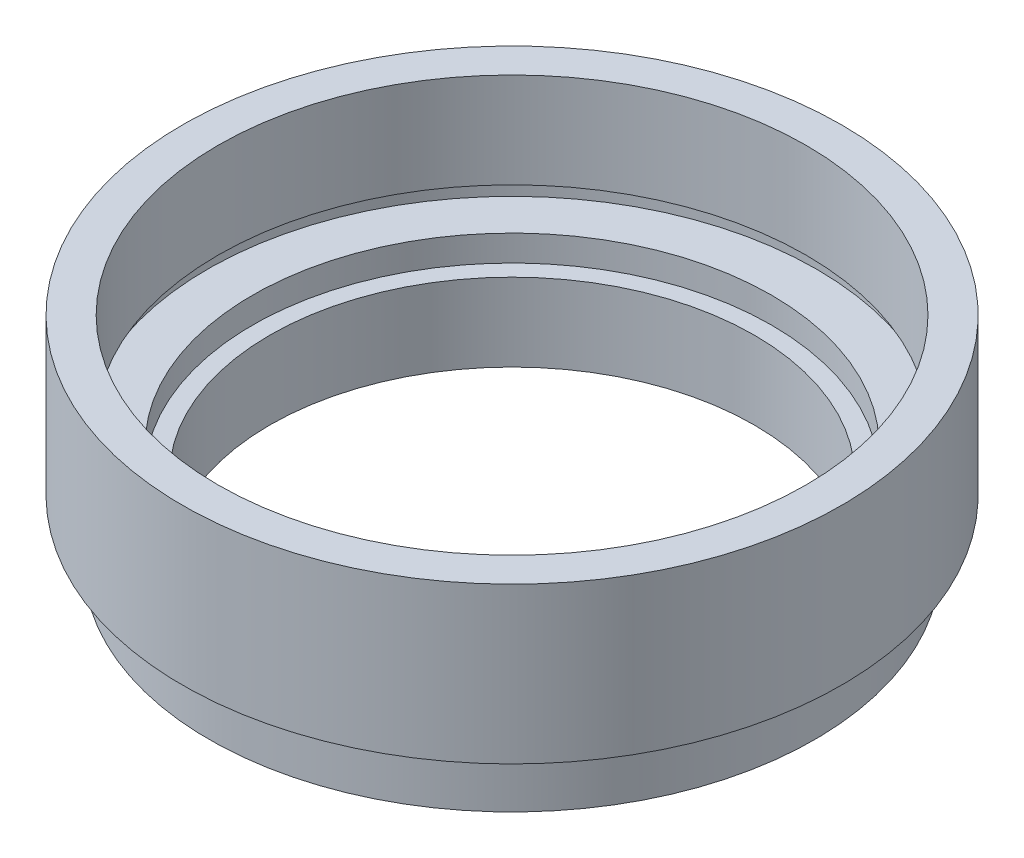
ISO-10303-21;
HEADER;
FILE_DESCRIPTION(('STEP AP214'),'2;1');
FILE_NAME('part.step','',(''),(''),'','','');
FILE_SCHEMA(('AUTOMOTIVE_DESIGN { 1 0 10303 214 1 1 1 1 }'));
ENDSEC;
DATA;
#1=APPLICATION_CONTEXT('core data for automotive mechanical design processes');
#2=APPLICATION_PROTOCOL_DEFINITION('international standard','automotive_design',2000,#1);
#3=PRODUCT_CONTEXT('',#1,'mechanical');
#4=PRODUCT('Part','Part','',(#3));
#5=PRODUCT_RELATED_PRODUCT_CATEGORY('part','',(#4));
#6=PRODUCT_DEFINITION_FORMATION('','',#4);
#7=PRODUCT_DEFINITION_CONTEXT('part definition',#1,'design');
#8=PRODUCT_DEFINITION('design','',#6,#7);
#9=PRODUCT_DEFINITION_SHAPE('','',#8);
#10=(LENGTH_UNIT() NAMED_UNIT(*) SI_UNIT(.MILLI.,.METRE.));
#11=(NAMED_UNIT(*) PLANE_ANGLE_UNIT() SI_UNIT($,.RADIAN.));
#12=(NAMED_UNIT(*) SI_UNIT($,.STERADIAN.) SOLID_ANGLE_UNIT());
#13=UNCERTAINTY_MEASURE_WITH_UNIT(LENGTH_MEASURE(1.E-05),#10,'distance_accuracy_value','');
#14=(GEOMETRIC_REPRESENTATION_CONTEXT(3) GLOBAL_UNCERTAINTY_ASSIGNED_CONTEXT((#13)) GLOBAL_UNIT_ASSIGNED_CONTEXT((#10,
#11,#12)) REPRESENTATION_CONTEXT('',''));
#15=CARTESIAN_POINT('',(0.,0.,0.));
#16=DIRECTION('',(0.,0.,1.));
#17=DIRECTION('',(1.,0.,0.));
#18=AXIS2_PLACEMENT_3D('',#15,#16,#17);
#19=CARTESIAN_POINT('',(0.,0.,0.));
#20=DIRECTION('',(0.,-1.,0.));
#21=DIRECTION('',(0.,0.,-1.));
#22=AXIS2_PLACEMENT_3D('',#19,#20,#21);
#23=CYLINDRICAL_SURFACE('',#22,14.);
#24=CARTESIAN_POINT('',(0.,0.,0.));
#25=DIRECTION('',(0.,-1.,0.));
#26=DIRECTION('',(0.,0.,-1.));
#27=AXIS2_PLACEMENT_3D('',#24,#25,#26);
#28=CIRCLE('',#27,14.);
#29=CARTESIAN_POINT('',(0.,0.,-14.));
#30=VERTEX_POINT('',#29);
#31=EDGE_CURVE('E10',#30,#30,#28,.T.);
#32=ORIENTED_EDGE('',*,*,#31,.T.);
#33=EDGE_LOOP('',(#32));
#34=FACE_BOUND('',#33,.T.);
#35=CARTESIAN_POINT('',(0.,4.5,0.));
#36=DIRECTION('',(0.,-1.,0.));
#37=DIRECTION('',(0.,0.,-1.));
#38=AXIS2_PLACEMENT_3D('',#35,#36,#37);
#39=CIRCLE('',#38,14.);
#40=CARTESIAN_POINT('',(0.,4.5,-14.));
#41=VERTEX_POINT('',#40);
#42=EDGE_CURVE('E77',#41,#41,#39,.T.);
#43=ORIENTED_EDGE('',*,*,#42,.F.);
#44=EDGE_LOOP('',(#43));
#45=FACE_BOUND('',#44,.T.);
#46=ADVANCED_FACE('F31',(#34,#45),#23,.F.);
#47=CARTESIAN_POINT('',(14.,0.,0.));
#48=DIRECTION('',(0.,-1.,0.));
#49=DIRECTION('',(0.,0.,-1.));
#50=AXIS2_PLACEMENT_3D('',#47,#48,#49);
#51=PLANE('',#50);
#52=CARTESIAN_POINT('',(0.,0.,0.));
#53=DIRECTION('',(0.,-1.,0.));
#54=DIRECTION('',(0.,0.,-1.));
#55=AXIS2_PLACEMENT_3D('',#52,#53,#54);
#56=CIRCLE('',#55,17.5);
#57=CARTESIAN_POINT('',(0.,0.,-17.5));
#58=VERTEX_POINT('',#57);
#59=EDGE_CURVE('E37',#58,#58,#56,.T.);
#60=ORIENTED_EDGE('',*,*,#59,.T.);
#61=EDGE_LOOP('',(#60));
#62=FACE_BOUND('',#61,.T.);
#63=ORIENTED_EDGE('',*,*,#31,.F.);
#64=EDGE_LOOP('',(#63));
#65=FACE_BOUND('',#64,.T.);
#66=ADVANCED_FACE('F85',(#62,#65),#51,.T.);
#67=CARTESIAN_POINT('',(0.,0.,0.));
#68=DIRECTION('',(0.,-1.,0.));
#69=DIRECTION('',(0.,0.,-1.));
#70=AXIS2_PLACEMENT_3D('',#67,#68,#69);
#71=CYLINDRICAL_SURFACE('',#70,17.5);
#72=CARTESIAN_POINT('',(0.,2.5,0.));
#73=DIRECTION('',(0.,-1.,0.));
#74=DIRECTION('',(0.,0.,-1.));
#75=AXIS2_PLACEMENT_3D('',#72,#73,#74);
#76=CIRCLE('',#75,17.5);
#77=CARTESIAN_POINT('',(0.,2.5,-17.5));
#78=VERTEX_POINT('',#77);
#79=EDGE_CURVE('E41',#78,#78,#76,.T.);
#80=ORIENTED_EDGE('',*,*,#79,.T.);
#81=EDGE_LOOP('',(#80));
#82=FACE_BOUND('',#81,.T.);
#83=ORIENTED_EDGE('',*,*,#59,.F.);
#84=EDGE_LOOP('',(#83));
#85=FACE_BOUND('',#84,.T.);
#86=ADVANCED_FACE('F89',(#82,#85),#71,.T.);
#87=CARTESIAN_POINT('',(17.5,2.5,0.));
#88=DIRECTION('',(0.,1.,0.));
#89=DIRECTION('',(0.,0.,1.));
#90=AXIS2_PLACEMENT_3D('',#87,#88,#89);
#91=PLANE('',#90);
#92=CARTESIAN_POINT('',(0.,2.5,0.));
#93=DIRECTION('',(0.,-1.,0.));
#94=DIRECTION('',(0.,0.,-1.));
#95=AXIS2_PLACEMENT_3D('',#92,#93,#94);
#96=CIRCLE('',#95,17.);
#97=CARTESIAN_POINT('',(0.,2.5,-17.));
#98=VERTEX_POINT('',#97);
#99=EDGE_CURVE('E45',#98,#98,#96,.T.);
#100=ORIENTED_EDGE('',*,*,#99,.T.);
#101=EDGE_LOOP('',(#100));
#102=FACE_BOUND('',#101,.T.);
#103=ORIENTED_EDGE('',*,*,#79,.F.);
#104=EDGE_LOOP('',(#103));
#105=FACE_BOUND('',#104,.T.);
#106=ADVANCED_FACE('F93',(#102,#105),#91,.T.);
#107=CARTESIAN_POINT('',(0.,0.,0.));
#108=DIRECTION('',(0.,-1.,0.));
#109=DIRECTION('',(0.,0.,-1.));
#110=AXIS2_PLACEMENT_3D('',#107,#108,#109);
#111=CYLINDRICAL_SURFACE('',#110,17.);
#112=CARTESIAN_POINT('',(0.,3.5,0.));
#113=DIRECTION('',(0.,-1.,0.));
#114=DIRECTION('',(0.,0.,-1.));
#115=AXIS2_PLACEMENT_3D('',#112,#113,#114);
#116=CIRCLE('',#115,17.);
#117=CARTESIAN_POINT('',(0.,3.5,-17.));
#118=VERTEX_POINT('',#117);
#119=EDGE_CURVE('E50',#118,#118,#116,.T.);
#120=ORIENTED_EDGE('',*,*,#119,.T.);
#121=EDGE_LOOP('',(#120));
#122=FACE_BOUND('',#121,.T.);
#123=ORIENTED_EDGE('',*,*,#99,.F.);
#124=EDGE_LOOP('',(#123));
#125=FACE_BOUND('',#124,.T.);
#126=ADVANCED_FACE('F100',(#122,#125),#111,.T.);
#127=CARTESIAN_POINT('',(17.,3.5,0.));
#128=DIRECTION('',(0.,-1.,0.));
#129=DIRECTION('',(0.,0.,-1.));
#130=AXIS2_PLACEMENT_3D('',#127,#128,#129);
#131=PLANE('',#130);
#132=CARTESIAN_POINT('',(0.,3.5,0.));
#133=DIRECTION('',(0.,-1.,0.));
#134=DIRECTION('',(0.,0.,-1.));
#135=AXIS2_PLACEMENT_3D('',#132,#133,#134);
#136=CIRCLE('',#135,19.05);
#137=CARTESIAN_POINT('',(0.,3.5,-19.05));
#138=VERTEX_POINT('',#137);
#139=EDGE_CURVE('E53',#138,#138,#136,.T.);
#140=ORIENTED_EDGE('',*,*,#139,.T.);
#141=EDGE_LOOP('',(#140));
#142=FACE_BOUND('',#141,.T.);
#143=ORIENTED_EDGE('',*,*,#119,.F.);
#144=EDGE_LOOP('',(#143));
#145=FACE_BOUND('',#144,.T.);
#146=ADVANCED_FACE('F104',(#142,#145),#131,.T.);
#147=CARTESIAN_POINT('',(0.,0.,0.));
#148=DIRECTION('',(0.,-1.,0.));
#149=DIRECTION('',(0.,0.,-1.));
#150=AXIS2_PLACEMENT_3D('',#147,#148,#149);
#151=CYLINDRICAL_SURFACE('',#150,19.05);
#152=CARTESIAN_POINT('',(0.,12.5,0.));
#153=DIRECTION('',(0.,-1.,0.));
#154=DIRECTION('',(0.,0.,-1.));
#155=AXIS2_PLACEMENT_3D('',#152,#153,#154);
#156=CIRCLE('',#155,19.05);
#157=CARTESIAN_POINT('',(0.,12.5,-19.05));
#158=VERTEX_POINT('',#157);
#159=EDGE_CURVE('E56',#158,#158,#156,.T.);
#160=ORIENTED_EDGE('',*,*,#159,.T.);
#161=EDGE_LOOP('',(#160));
#162=FACE_BOUND('',#161,.T.);
#163=ORIENTED_EDGE('',*,*,#139,.F.);
#164=EDGE_LOOP('',(#163));
#165=FACE_BOUND('',#164,.T.);
#166=ADVANCED_FACE('F108',(#162,#165),#151,.T.);
#167=CARTESIAN_POINT('',(19.05,12.5,0.));
#168=DIRECTION('',(0.,1.,0.));
#169=DIRECTION('',(0.,0.,1.));
#170=AXIS2_PLACEMENT_3D('',#167,#168,#169);
#171=PLANE('',#170);
#172=CARTESIAN_POINT('',(0.,12.5,0.));
#173=DIRECTION('',(0.,-1.,0.));
#174=DIRECTION('',(0.,0.,-1.));
#175=AXIS2_PLACEMENT_3D('',#172,#173,#174);
#176=CIRCLE('',#175,17.);
#177=CARTESIAN_POINT('',(0.,12.5,-17.));
#178=VERTEX_POINT('',#177);
#179=EDGE_CURVE('E59',#178,#178,#176,.T.);
#180=ORIENTED_EDGE('',*,*,#179,.T.);
#181=EDGE_LOOP('',(#180));
#182=FACE_BOUND('',#181,.T.);
#183=ORIENTED_EDGE('',*,*,#159,.F.);
#184=EDGE_LOOP('',(#183));
#185=FACE_BOUND('',#184,.T.);
#186=ADVANCED_FACE('F112',(#182,#185),#171,.T.);
#187=CARTESIAN_POINT('',(0.,0.,0.));
#188=DIRECTION('',(0.,-1.,0.));
#189=DIRECTION('',(0.,0.,-1.));
#190=AXIS2_PLACEMENT_3D('',#187,#188,#189);
#191=CYLINDRICAL_SURFACE('',#190,17.);
#192=CARTESIAN_POINT('',(0.,7.,0.));
#193=DIRECTION('',(0.,-1.,0.));
#194=DIRECTION('',(0.,0.,-1.));
#195=AXIS2_PLACEMENT_3D('',#192,#193,#194);
#196=CIRCLE('',#195,17.);
#197=CARTESIAN_POINT('',(0.,7.,-17.));
#198=VERTEX_POINT('',#197);
#199=EDGE_CURVE('E62',#198,#198,#196,.T.);
#200=ORIENTED_EDGE('',*,*,#199,.T.);
#201=EDGE_LOOP('',(#200));
#202=FACE_BOUND('',#201,.T.);
#203=ORIENTED_EDGE('',*,*,#179,.F.);
#204=EDGE_LOOP('',(#203));
#205=FACE_BOUND('',#204,.T.);
#206=ADVANCED_FACE('F116',(#202,#205),#191,.F.);
#207=CARTESIAN_POINT('',(17.,7.,0.));
#208=DIRECTION('',(0.,-1.,0.));
#209=DIRECTION('',(0.,0.,-1.));
#210=AXIS2_PLACEMENT_3D('',#207,#208,#209);
#211=PLANE('',#210);
#212=CARTESIAN_POINT('',(0.,7.,0.));
#213=DIRECTION('',(0.,-1.,0.));
#214=DIRECTION('',(0.,0.,-1.));
#215=AXIS2_PLACEMENT_3D('',#212,#213,#214);
#216=CIRCLE('',#215,17.6);
#217=CARTESIAN_POINT('',(0.,7.,-17.6));
#218=VERTEX_POINT('',#217);
#219=EDGE_CURVE('E65',#218,#218,#216,.T.);
#220=ORIENTED_EDGE('',*,*,#219,.T.);
#221=EDGE_LOOP('',(#220));
#222=FACE_BOUND('',#221,.T.);
#223=ORIENTED_EDGE('',*,*,#199,.F.);
#224=EDGE_LOOP('',(#223));
#225=FACE_BOUND('',#224,.T.);
#226=ADVANCED_FACE('F120',(#222,#225),#211,.T.);
#227=CARTESIAN_POINT('',(0.,0.,0.));
#228=DIRECTION('',(0.,-1.,0.));
#229=DIRECTION('',(0.,0.,-1.));
#230=AXIS2_PLACEMENT_3D('',#227,#228,#229);
#231=CYLINDRICAL_SURFACE('',#230,17.6);
#232=CARTESIAN_POINT('',(0.,6.,0.));
#233=DIRECTION('',(0.,-1.,0.));
#234=DIRECTION('',(0.,0.,-1.));
#235=AXIS2_PLACEMENT_3D('',#232,#233,#234);
#236=CIRCLE('',#235,17.6);
#237=CARTESIAN_POINT('',(0.,6.,-17.6));
#238=VERTEX_POINT('',#237);
#239=EDGE_CURVE('E68',#238,#238,#236,.T.);
#240=ORIENTED_EDGE('',*,*,#239,.T.);
#241=EDGE_LOOP('',(#240));
#242=FACE_BOUND('',#241,.T.);
#243=ORIENTED_EDGE('',*,*,#219,.F.);
#244=EDGE_LOOP('',(#243));
#245=FACE_BOUND('',#244,.T.);
#246=ADVANCED_FACE('F124',(#242,#245),#231,.F.);
#247=CARTESIAN_POINT('',(17.6,6.,0.));
#248=DIRECTION('',(0.,1.,0.));
#249=DIRECTION('',(0.,0.,1.));
#250=AXIS2_PLACEMENT_3D('',#247,#248,#249);
#251=PLANE('',#250);
#252=CARTESIAN_POINT('',(0.,6.,0.));
#253=DIRECTION('',(0.,-1.,0.));
#254=DIRECTION('',(0.,0.,-1.));
#255=AXIS2_PLACEMENT_3D('',#252,#253,#254);
#256=CIRCLE('',#255,15.);
#257=CARTESIAN_POINT('',(0.,6.,-15.));
#258=VERTEX_POINT('',#257);
#259=EDGE_CURVE('E71',#258,#258,#256,.T.);
#260=ORIENTED_EDGE('',*,*,#259,.T.);
#261=EDGE_LOOP('',(#260));
#262=FACE_BOUND('',#261,.T.);
#263=ORIENTED_EDGE('',*,*,#239,.F.);
#264=EDGE_LOOP('',(#263));
#265=FACE_BOUND('',#264,.T.);
#266=ADVANCED_FACE('F128',(#262,#265),#251,.T.);
#267=CARTESIAN_POINT('',(0.,0.,0.));
#268=DIRECTION('',(0.,-1.,0.));
#269=DIRECTION('',(0.,0.,-1.));
#270=AXIS2_PLACEMENT_3D('',#267,#268,#269);
#271=CYLINDRICAL_SURFACE('',#270,15.);
#272=CARTESIAN_POINT('',(0.,4.5,0.));
#273=DIRECTION('',(0.,-1.,0.));
#274=DIRECTION('',(0.,0.,-1.));
#275=AXIS2_PLACEMENT_3D('',#272,#273,#274);
#276=CIRCLE('',#275,15.);
#277=CARTESIAN_POINT('',(0.,4.5,-15.));
#278=VERTEX_POINT('',#277);
#279=EDGE_CURVE('E74',#278,#278,#276,.T.);
#280=ORIENTED_EDGE('',*,*,#279,.T.);
#281=EDGE_LOOP('',(#280));
#282=FACE_BOUND('',#281,.T.);
#283=ORIENTED_EDGE('',*,*,#259,.F.);
#284=EDGE_LOOP('',(#283));
#285=FACE_BOUND('',#284,.T.);
#286=ADVANCED_FACE('F132',(#282,#285),#271,.F.);
#287=CARTESIAN_POINT('',(15.,4.5,0.));
#288=DIRECTION('',(0.,1.,0.));
#289=DIRECTION('',(0.,0.,1.));
#290=AXIS2_PLACEMENT_3D('',#287,#288,#289);
#291=PLANE('',#290);
#292=ORIENTED_EDGE('',*,*,#42,.T.);
#293=EDGE_LOOP('',(#292));
#294=FACE_BOUND('',#293,.T.);
#295=ORIENTED_EDGE('',*,*,#279,.F.);
#296=EDGE_LOOP('',(#295));
#297=FACE_BOUND('',#296,.T.);
#298=ADVANCED_FACE('F81',(#294,#297),#291,.T.);
#299=CLOSED_SHELL('',(#46,#66,#86,#106,#126,#146,#166,#186,#206,#226,#246,#266,#286,#298));
#300=MANIFOLD_SOLID_BREP('B2',#299);
#301=ADVANCED_BREP_SHAPE_REPRESENTATION('',(#18,#300),#14);
#302=SHAPE_DEFINITION_REPRESENTATION(#9,#301);
ENDSEC;
END-ISO-10303-21;
